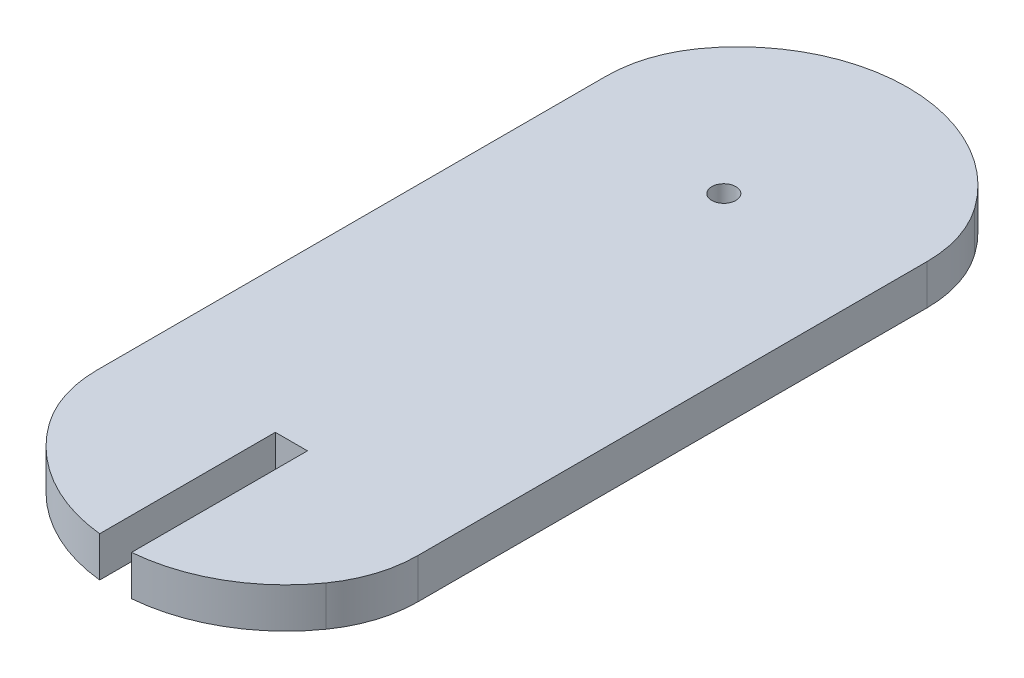
ISO-10303-21;
HEADER;
FILE_DESCRIPTION(('STEP AP214'),'2;1');
FILE_NAME('part.step','',(''),(''),'','','');
FILE_SCHEMA(('AUTOMOTIVE_DESIGN { 1 0 10303 214 1 1 1 1 }'));
ENDSEC;
DATA;
#1=APPLICATION_CONTEXT('core data for automotive mechanical design processes');
#2=APPLICATION_PROTOCOL_DEFINITION('international standard','automotive_design',2000,#1);
#3=PRODUCT_CONTEXT('',#1,'mechanical');
#4=PRODUCT('Part','Part','',(#3));
#5=PRODUCT_RELATED_PRODUCT_CATEGORY('part','',(#4));
#6=PRODUCT_DEFINITION_FORMATION('','',#4);
#7=PRODUCT_DEFINITION_CONTEXT('part definition',#1,'design');
#8=PRODUCT_DEFINITION('design','',#6,#7);
#9=PRODUCT_DEFINITION_SHAPE('','',#8);
#10=(LENGTH_UNIT() NAMED_UNIT(*) SI_UNIT(.MILLI.,.METRE.));
#11=(NAMED_UNIT(*) PLANE_ANGLE_UNIT() SI_UNIT($,.RADIAN.));
#12=(NAMED_UNIT(*) SI_UNIT($,.STERADIAN.) SOLID_ANGLE_UNIT());
#13=UNCERTAINTY_MEASURE_WITH_UNIT(LENGTH_MEASURE(1.E-05),#10,'distance_accuracy_value','');
#14=(GEOMETRIC_REPRESENTATION_CONTEXT(3) GLOBAL_UNCERTAINTY_ASSIGNED_CONTEXT((#13)) GLOBAL_UNIT_ASSIGNED_CONTEXT((#10,
#11,#12)) REPRESENTATION_CONTEXT('',''));
#15=CARTESIAN_POINT('',(0.,0.,0.));
#16=DIRECTION('',(0.,0.,1.));
#17=DIRECTION('',(1.,0.,0.));
#18=AXIS2_PLACEMENT_3D('',#15,#16,#17);
#19=CARTESIAN_POINT('',(0.,5.,28.1826031360937));
#20=DIRECTION('',(0.,-1.,0.));
#21=DIRECTION('',(0.,0.,-1.));
#22=AXIS2_PLACEMENT_3D('',#19,#20,#21);
#23=CYLINDRICAL_SURFACE('',#22,21.13);
#24=CARTESIAN_POINT('',(0.,5.,28.1826031360937));
#25=DIRECTION('',(0.,1.,0.));
#26=DIRECTION('',(0.,0.,1.));
#27=AXIS2_PLACEMENT_3D('',#24,#25,#26);
#28=CIRCLE('',#27,21.13);
#29=CARTESIAN_POINT('',(1.82374823296328,5.,49.2337513799012));
#30=VERTEX_POINT('',#29);
#31=CARTESIAN_POINT('',(17.2349102773246,5.,40.406954559894));
#32=VERTEX_POINT('',#31);
#33=EDGE_CURVE('E162',#30,#32,#28,.T.);
#34=ORIENTED_EDGE('',*,*,#33,.F.);
#35=DIRECTION('',(0.,-1.,0.));
#36=VECTOR('',#35,1.);
#37=CARTESIAN_POINT('',(1.82374823296328,5.,49.2337513799012));
#38=LINE('',#37,#36);
#39=CARTESIAN_POINT('',(1.82374823296328,0.,49.2337513799012));
#40=VERTEX_POINT('',#39);
#41=EDGE_CURVE('E156',#30,#40,#38,.T.);
#42=ORIENTED_EDGE('',*,*,#41,.T.);
#43=CARTESIAN_POINT('',(0.,0.,28.1826031360937));
#44=DIRECTION('',(0.,1.,0.));
#45=DIRECTION('',(0.,0.,1.));
#46=AXIS2_PLACEMENT_3D('',#43,#44,#45);
#47=CIRCLE('',#46,21.13);
#48=CARTESIAN_POINT('',(17.2349102773246,0.,40.406954559894));
#49=VERTEX_POINT('',#48);
#50=EDGE_CURVE('E159',#40,#49,#47,.T.);
#51=ORIENTED_EDGE('',*,*,#50,.T.);
#52=DIRECTION('',(0.,-1.,0.));
#53=VECTOR('',#52,1.);
#54=CARTESIAN_POINT('',(17.2349102773246,5.,40.406954559894));
#55=LINE('',#54,#53);
#56=EDGE_CURVE('E199',#49,#32,#55,.F.);
#57=ORIENTED_EDGE('',*,*,#56,.T.);
#58=EDGE_LOOP('',(#34,#42,#51,#57));
#59=FACE_BOUND('',#58,.T.);
#60=ADVANCED_FACE('F34',(#59),#23,.T.);
#61=CARTESIAN_POINT('',(-17.2349102773246,0.,40.406954559894));
#62=VERTEX_POINT('',#61);
#63=CARTESIAN_POINT('',(-2.17625176703672,0.,49.2002345023173));
#64=VERTEX_POINT('',#63);
#65=EDGE_CURVE('E171',#62,#64,#47,.T.);
#66=ORIENTED_EDGE('',*,*,#65,.T.);
#67=DIRECTION('',(0.,-1.,0.));
#68=VECTOR('',#67,1.);
#69=CARTESIAN_POINT('',(-2.17625176703672,5.,49.2002345023173));
#70=LINE('',#69,#68);
#71=CARTESIAN_POINT('',(-2.17625176703672,5.,49.2002345023173));
#72=VERTEX_POINT('',#71);
#73=EDGE_CURVE('E49',#64,#72,#70,.F.);
#74=ORIENTED_EDGE('',*,*,#73,.T.);
#75=CARTESIAN_POINT('',(-17.2349102773246,5.,40.406954559894));
#76=VERTEX_POINT('',#75);
#77=EDGE_CURVE('E142',#76,#72,#28,.T.);
#78=ORIENTED_EDGE('',*,*,#77,.F.);
#79=DIRECTION('',(0.,-1.,0.));
#80=VECTOR('',#79,1.);
#81=CARTESIAN_POINT('',(-17.2349102773246,5.,40.406954559894));
#82=LINE('',#81,#80);
#83=EDGE_CURVE('E196',#76,#62,#82,.T.);
#84=ORIENTED_EDGE('',*,*,#83,.T.);
#85=EDGE_LOOP('',(#66,#74,#78,#84));
#86=FACE_BOUND('',#85,.T.);
#87=ADVANCED_FACE('F238',(#86),#23,.T.);
#88=CARTESIAN_POINT('',(20.,5.,0.));
#89=DIRECTION('',(-1.,0.,0.));
#90=DIRECTION('',(0.,0.,1.));
#91=AXIS2_PLACEMENT_3D('',#88,#89,#90);
#92=PLANE('',#91);
#93=DIRECTION('',(0.,0.,-1.));
#94=VECTOR('',#93,1.);
#95=CARTESIAN_POINT('',(20.,5.,0.));
#96=LINE('',#95,#94);
#97=CARTESIAN_POINT('',(20.,5.,31.728995669359));
#98=VERTEX_POINT('',#97);
#99=CARTESIAN_POINT('',(20.,5.,-31.7243272605895));
#100=VERTEX_POINT('',#99);
#101=EDGE_CURVE('E161',#98,#100,#96,.T.);
#102=ORIENTED_EDGE('',*,*,#101,.F.);
#103=DIRECTION('',(0.,-1.,0.));
#104=VECTOR('',#103,1.);
#105=CARTESIAN_POINT('',(20.,5.,31.728995669359));
#106=LINE('',#105,#104);
#107=CARTESIAN_POINT('',(20.,0.,31.728995669359));
#108=VERTEX_POINT('',#107);
#109=EDGE_CURVE('E184',#98,#108,#106,.T.);
#110=ORIENTED_EDGE('',*,*,#109,.T.);
#111=DIRECTION('',(0.,0.,-1.));
#112=VECTOR('',#111,1.);
#113=CARTESIAN_POINT('',(20.,0.,0.));
#114=LINE('',#113,#112);
#115=CARTESIAN_POINT('',(20.,0.,-31.7243272605895));
#116=VERTEX_POINT('',#115);
#117=EDGE_CURVE('E174',#108,#116,#114,.T.);
#118=ORIENTED_EDGE('',*,*,#117,.T.);
#119=DIRECTION('',(0.,1.,0.));
#120=VECTOR('',#119,1.);
#121=CARTESIAN_POINT('',(20.,5.,-31.7243272605895));
#122=LINE('',#121,#120);
#123=EDGE_CURVE('E170',#116,#100,#122,.T.);
#124=ORIENTED_EDGE('',*,*,#123,.T.);
#125=EDGE_LOOP('',(#102,#110,#118,#124));
#126=FACE_BOUND('',#125,.T.);
#127=ADVANCED_FACE('F240',(#126),#92,.F.);
#128=CARTESIAN_POINT('',(0.,5.,-28.1720466483781));
#129=DIRECTION('',(0.,-1.,0.));
#130=DIRECTION('',(0.,0.,-1.));
#131=AXIS2_PLACEMENT_3D('',#128,#129,#130);
#132=CYLINDRICAL_SURFACE('',#131,21.1334083141344);
#133=CARTESIAN_POINT('',(0.,0.,-28.1720466483781));
#134=DIRECTION('',(0.,1.,0.));
#135=DIRECTION('',(0.,0.,1.));
#136=AXIS2_PLACEMENT_3D('',#133,#134,#135);
#137=CIRCLE('',#136,21.1334083141344);
#138=CARTESIAN_POINT('',(-17.2281113793065,0.,-40.4118638559239));
#139=VERTEX_POINT('',#138);
#140=CARTESIAN_POINT('',(17.2281113793065,0.,-40.4118638559239));
#141=VERTEX_POINT('',#140);
#142=EDGE_CURVE('E177',#139,#141,#137,.F.);
#143=ORIENTED_EDGE('',*,*,#142,.F.);
#144=DIRECTION('',(0.,-1.,0.));
#145=VECTOR('',#144,1.);
#146=CARTESIAN_POINT('',(-17.2281113793065,5.,-40.4118638559239));
#147=LINE('',#146,#145);
#148=CARTESIAN_POINT('',(-17.2281113793065,5.,-40.4118638559239));
#149=VERTEX_POINT('',#148);
#150=EDGE_CURVE('E42',#139,#149,#147,.F.);
#151=ORIENTED_EDGE('',*,*,#150,.T.);
#152=CARTESIAN_POINT('',(0.,5.,-28.1720466483781));
#153=DIRECTION('',(0.,1.,0.));
#154=DIRECTION('',(0.,0.,1.));
#155=AXIS2_PLACEMENT_3D('',#152,#153,#154);
#156=CIRCLE('',#155,21.1334083141344);
#157=CARTESIAN_POINT('',(17.2281113793065,5.,-40.4118638559239));
#158=VERTEX_POINT('',#157);
#159=EDGE_CURVE('E165',#149,#158,#156,.F.);
#160=ORIENTED_EDGE('',*,*,#159,.T.);
#161=DIRECTION('',(0.,-1.,0.));
#162=VECTOR('',#161,1.);
#163=CARTESIAN_POINT('',(17.2281113793065,5.,-40.4118638559239));
#164=LINE('',#163,#162);
#165=EDGE_CURVE('E214',#158,#141,#164,.T.);
#166=ORIENTED_EDGE('',*,*,#165,.T.);
#167=EDGE_LOOP('',(#143,#151,#160,#166));
#168=FACE_BOUND('',#167,.T.);
#169=ADVANCED_FACE('F219',(#168),#132,.T.);
#170=CARTESIAN_POINT('',(-20.,5.,0.));
#171=DIRECTION('',(-1.,0.,0.));
#172=DIRECTION('',(0.,0.,1.));
#173=AXIS2_PLACEMENT_3D('',#170,#171,#172);
#174=PLANE('',#173);
#175=DIRECTION('',(0.,0.,-1.));
#176=VECTOR('',#175,1.);
#177=CARTESIAN_POINT('',(-20.,0.,0.));
#178=LINE('',#177,#176);
#179=CARTESIAN_POINT('',(-20.,0.,31.728995669359));
#180=VERTEX_POINT('',#179);
#181=CARTESIAN_POINT('',(-20.,0.,-31.7243272605895));
#182=VERTEX_POINT('',#181);
#183=EDGE_CURVE('E180',#180,#182,#178,.T.);
#184=ORIENTED_EDGE('',*,*,#183,.F.);
#185=DIRECTION('',(0.,1.,0.));
#186=VECTOR('',#185,1.);
#187=CARTESIAN_POINT('',(-20.,5.,31.728995669359));
#188=LINE('',#187,#186);
#189=CARTESIAN_POINT('',(-20.,5.,31.728995669359));
#190=VERTEX_POINT('',#189);
#191=EDGE_CURVE('E212',#180,#190,#188,.T.);
#192=ORIENTED_EDGE('',*,*,#191,.T.);
#193=DIRECTION('',(0.,0.,-1.));
#194=VECTOR('',#193,1.);
#195=CARTESIAN_POINT('',(-20.,5.,0.));
#196=LINE('',#195,#194);
#197=CARTESIAN_POINT('',(-20.,5.,-31.7243272605895));
#198=VERTEX_POINT('',#197);
#199=EDGE_CURVE('E168',#190,#198,#196,.T.);
#200=ORIENTED_EDGE('',*,*,#199,.T.);
#201=DIRECTION('',(0.,-1.,0.));
#202=VECTOR('',#201,1.);
#203=CARTESIAN_POINT('',(-20.,5.,-31.7243272605895));
#204=LINE('',#203,#202);
#205=EDGE_CURVE('E209',#198,#182,#204,.T.);
#206=ORIENTED_EDGE('',*,*,#205,.T.);
#207=EDGE_LOOP('',(#184,#192,#200,#206));
#208=FACE_BOUND('',#207,.T.);
#209=ADVANCED_FACE('F227',(#208),#174,.T.);
#210=CARTESIAN_POINT('',(0.,5.,0.));
#211=DIRECTION('',(0.,1.,0.));
#212=DIRECTION('',(0.,0.,1.));
#213=AXIS2_PLACEMENT_3D('',#210,#211,#212);
#214=PLANE('',#213);
#215=CARTESIAN_POINT('',(0.,5.,-26.3873968639063));
#216=DIRECTION('',(0.,-1.,0.));
#217=DIRECTION('',(0.,0.,-1.));
#218=AXIS2_PLACEMENT_3D('',#215,#216,#217);
#219=CIRCLE('',#218,1.5);
#220=CARTESIAN_POINT('',(0.,5.,-27.8873968639063));
#221=VERTEX_POINT('',#220);
#222=EDGE_CURVE('E152',#221,#221,#219,.T.);
#223=ORIENTED_EDGE('',*,*,#222,.T.);
#224=EDGE_LOOP('',(#223));
#225=FACE_BOUND('',#224,.T.);
#226=DIRECTION('',(0.,0.,1.));
#227=VECTOR('',#226,1.);
#228=CARTESIAN_POINT('',(1.82374823296328,5.,49.3126031360937));
#229=LINE('',#228,#227);
#230=CARTESIAN_POINT('',(1.82374823296328,5.,27.3126031360937));
#231=VERTEX_POINT('',#230);
#232=EDGE_CURVE('E131',#231,#30,#229,.T.);
#233=ORIENTED_EDGE('',*,*,#232,.T.);
#234=ORIENTED_EDGE('',*,*,#33,.T.);
#235=CARTESIAN_POINT('',(5.,5.,31.728995669359));
#236=DIRECTION('',(0.,1.,0.));
#237=DIRECTION('',(0.,0.,1.));
#238=AXIS2_PLACEMENT_3D('',#235,#236,#237);
#239=CIRCLE('',#238,15.);
#240=EDGE_CURVE('E207',#32,#98,#239,.T.);
#241=ORIENTED_EDGE('',*,*,#240,.T.);
#242=ORIENTED_EDGE('',*,*,#101,.T.);
#243=CARTESIAN_POINT('',(5.,5.,-31.7243272605895));
#244=DIRECTION('',(0.,1.,0.));
#245=DIRECTION('',(0.,0.,1.));
#246=AXIS2_PLACEMENT_3D('',#243,#244,#245);
#247=CIRCLE('',#246,15.);
#248=EDGE_CURVE('E202',#100,#158,#247,.T.);
#249=ORIENTED_EDGE('',*,*,#248,.T.);
#250=ORIENTED_EDGE('',*,*,#159,.F.);
#251=CARTESIAN_POINT('',(-5.,5.,-31.7243272605895));
#252=DIRECTION('',(0.,1.,0.));
#253=DIRECTION('',(0.,0.,1.));
#254=AXIS2_PLACEMENT_3D('',#251,#252,#253);
#255=CIRCLE('',#254,15.);
#256=EDGE_CURVE('E56',#149,#198,#255,.T.);
#257=ORIENTED_EDGE('',*,*,#256,.T.);
#258=ORIENTED_EDGE('',*,*,#199,.F.);
#259=CARTESIAN_POINT('',(-5.,5.,31.728995669359));
#260=DIRECTION('',(0.,1.,0.));
#261=DIRECTION('',(0.,0.,1.));
#262=AXIS2_PLACEMENT_3D('',#259,#260,#261);
#263=CIRCLE('',#262,15.);
#264=EDGE_CURVE('E205',#190,#76,#263,.T.);
#265=ORIENTED_EDGE('',*,*,#264,.T.);
#266=ORIENTED_EDGE('',*,*,#77,.T.);
#267=DIRECTION('',(0.,0.,-1.));
#268=VECTOR('',#267,1.);
#269=CARTESIAN_POINT('',(-2.17625176703672,5.,27.3126031360937));
#270=LINE('',#269,#268);
#271=CARTESIAN_POINT('',(-2.17625176703672,5.,27.3126031360937));
#272=VERTEX_POINT('',#271);
#273=EDGE_CURVE('E126',#72,#272,#270,.T.);
#274=ORIENTED_EDGE('',*,*,#273,.T.);
#275=DIRECTION('',(1.,0.,0.));
#276=VECTOR('',#275,1.);
#277=CARTESIAN_POINT('',(1.82374823296328,5.,27.3126031360937));
#278=LINE('',#277,#276);
#279=EDGE_CURVE('E134',#272,#231,#278,.T.);
#280=ORIENTED_EDGE('',*,*,#279,.T.);
#281=EDGE_LOOP('',(#233,#234,#241,#242,#249,#250,#257,#258,#265,#266,#274,#280));
#282=FACE_BOUND('',#281,.T.);
#283=ADVANCED_FACE('F140',(#225,#282),#214,.T.);
#284=CARTESIAN_POINT('',(0.,0.,0.));
#285=DIRECTION('',(0.,1.,0.));
#286=DIRECTION('',(0.,0.,1.));
#287=AXIS2_PLACEMENT_3D('',#284,#285,#286);
#288=PLANE('',#287);
#289=CARTESIAN_POINT('',(0.,0.,-26.3873968639063));
#290=DIRECTION('',(0.,-1.,0.));
#291=DIRECTION('',(0.,0.,-1.));
#292=AXIS2_PLACEMENT_3D('',#289,#290,#291);
#293=CIRCLE('',#292,1.5);
#294=CARTESIAN_POINT('',(0.,0.,-27.8873968639063));
#295=VERTEX_POINT('',#294);
#296=EDGE_CURVE('E148',#295,#295,#293,.T.);
#297=ORIENTED_EDGE('',*,*,#296,.F.);
#298=EDGE_LOOP('',(#297));
#299=FACE_BOUND('',#298,.T.);
#300=ORIENTED_EDGE('',*,*,#50,.F.);
#301=DIRECTION('',(0.,0.,1.));
#302=VECTOR('',#301,1.);
#303=CARTESIAN_POINT('',(1.82374823296328,0.,49.3126031360937));
#304=LINE('',#303,#302);
#305=CARTESIAN_POINT('',(1.82374823296328,0.,27.3126031360937));
#306=VERTEX_POINT('',#305);
#307=EDGE_CURVE('E143',#306,#40,#304,.T.);
#308=ORIENTED_EDGE('',*,*,#307,.F.);
#309=DIRECTION('',(1.,0.,0.));
#310=VECTOR('',#309,1.);
#311=CARTESIAN_POINT('',(1.82374823296328,0.,27.3126031360937));
#312=LINE('',#311,#310);
#313=CARTESIAN_POINT('',(-2.17625176703672,0.,27.3126031360937));
#314=VERTEX_POINT('',#313);
#315=EDGE_CURVE('E145',#314,#306,#312,.T.);
#316=ORIENTED_EDGE('',*,*,#315,.F.);
#317=DIRECTION('',(0.,0.,1.));
#318=VECTOR('',#317,1.);
#319=CARTESIAN_POINT('',(-2.17625176703671,0.,0.));
#320=LINE('',#319,#318);
#321=EDGE_CURVE('E11',#314,#64,#320,.T.);
#322=ORIENTED_EDGE('',*,*,#321,.T.);
#323=ORIENTED_EDGE('',*,*,#65,.F.);
#324=CARTESIAN_POINT('',(-5.,0.,31.728995669359));
#325=DIRECTION('',(0.,1.,0.));
#326=DIRECTION('',(0.,0.,1.));
#327=AXIS2_PLACEMENT_3D('',#324,#325,#326);
#328=CIRCLE('',#327,15.);
#329=EDGE_CURVE('E191',#62,#180,#328,.F.);
#330=ORIENTED_EDGE('',*,*,#329,.T.);
#331=ORIENTED_EDGE('',*,*,#183,.T.);
#332=CARTESIAN_POINT('',(-5.,0.,-31.7243272605895));
#333=DIRECTION('',(0.,1.,0.));
#334=DIRECTION('',(0.,0.,1.));
#335=AXIS2_PLACEMENT_3D('',#332,#333,#334);
#336=CIRCLE('',#335,15.);
#337=EDGE_CURVE('E189',#182,#139,#336,.F.);
#338=ORIENTED_EDGE('',*,*,#337,.T.);
#339=ORIENTED_EDGE('',*,*,#142,.T.);
#340=CARTESIAN_POINT('',(5.,0.,-31.7243272605895));
#341=DIRECTION('',(0.,1.,0.));
#342=DIRECTION('',(0.,0.,1.));
#343=AXIS2_PLACEMENT_3D('',#340,#341,#342);
#344=CIRCLE('',#343,15.);
#345=EDGE_CURVE('E187',#141,#116,#344,.F.);
#346=ORIENTED_EDGE('',*,*,#345,.T.);
#347=ORIENTED_EDGE('',*,*,#117,.F.);
#348=CARTESIAN_POINT('',(5.,0.,31.728995669359));
#349=DIRECTION('',(0.,1.,0.));
#350=DIRECTION('',(0.,0.,1.));
#351=AXIS2_PLACEMENT_3D('',#348,#349,#350);
#352=CIRCLE('',#351,15.);
#353=EDGE_CURVE('E193',#108,#49,#352,.F.);
#354=ORIENTED_EDGE('',*,*,#353,.T.);
#355=EDGE_LOOP('',(#300,#308,#316,#322,#323,#330,#331,#338,#339,#346,#347,#354));
#356=FACE_BOUND('',#355,.T.);
#357=ADVANCED_FACE('F231',(#299,#356),#288,.F.);
#358=CARTESIAN_POINT('',(5.,5.,31.728995669359));
#359=DIRECTION('',(0.,-1.,0.));
#360=DIRECTION('',(0.,0.,-1.));
#361=AXIS2_PLACEMENT_3D('',#358,#359,#360);
#362=CYLINDRICAL_SURFACE('',#361,15.);
#363=ORIENTED_EDGE('',*,*,#240,.F.);
#364=ORIENTED_EDGE('',*,*,#56,.F.);
#365=ORIENTED_EDGE('',*,*,#353,.F.);
#366=ORIENTED_EDGE('',*,*,#109,.F.);
#367=EDGE_LOOP('',(#363,#364,#365,#366));
#368=FACE_BOUND('',#367,.T.);
#369=ADVANCED_FACE('F251',(#368),#362,.T.);
#370=CARTESIAN_POINT('',(-5.,5.,31.728995669359));
#371=DIRECTION('',(0.,-1.,0.));
#372=DIRECTION('',(0.,0.,-1.));
#373=AXIS2_PLACEMENT_3D('',#370,#371,#372);
#374=CYLINDRICAL_SURFACE('',#373,15.);
#375=ORIENTED_EDGE('',*,*,#264,.F.);
#376=ORIENTED_EDGE('',*,*,#191,.F.);
#377=ORIENTED_EDGE('',*,*,#329,.F.);
#378=ORIENTED_EDGE('',*,*,#83,.F.);
#379=EDGE_LOOP('',(#375,#376,#377,#378));
#380=FACE_BOUND('',#379,.T.);
#381=ADVANCED_FACE('F236',(#380),#374,.T.);
#382=CARTESIAN_POINT('',(-5.,5.,-31.7243272605895));
#383=DIRECTION('',(0.,-1.,0.));
#384=DIRECTION('',(0.,0.,-1.));
#385=AXIS2_PLACEMENT_3D('',#382,#383,#384);
#386=CYLINDRICAL_SURFACE('',#385,15.);
#387=ORIENTED_EDGE('',*,*,#256,.F.);
#388=ORIENTED_EDGE('',*,*,#150,.F.);
#389=ORIENTED_EDGE('',*,*,#337,.F.);
#390=ORIENTED_EDGE('',*,*,#205,.F.);
#391=EDGE_LOOP('',(#387,#388,#389,#390));
#392=FACE_BOUND('',#391,.T.);
#393=ADVANCED_FACE('F224',(#392),#386,.T.);
#394=CARTESIAN_POINT('',(5.,5.,-31.7243272605895));
#395=DIRECTION('',(0.,-1.,0.));
#396=DIRECTION('',(0.,0.,-1.));
#397=AXIS2_PLACEMENT_3D('',#394,#395,#396);
#398=CYLINDRICAL_SURFACE('',#397,15.);
#399=ORIENTED_EDGE('',*,*,#248,.F.);
#400=ORIENTED_EDGE('',*,*,#123,.F.);
#401=ORIENTED_EDGE('',*,*,#345,.F.);
#402=ORIENTED_EDGE('',*,*,#165,.F.);
#403=EDGE_LOOP('',(#399,#400,#401,#402));
#404=FACE_BOUND('',#403,.T.);
#405=ADVANCED_FACE('F36',(#404),#398,.T.);
#406=CARTESIAN_POINT('',(1.82374823296328,5.,49.3126031360937));
#407=DIRECTION('',(1.,0.,0.));
#408=DIRECTION('',(0.,0.,-1.));
#409=AXIS2_PLACEMENT_3D('',#406,#407,#408);
#410=PLANE('',#409);
#411=ORIENTED_EDGE('',*,*,#232,.F.);
#412=DIRECTION('',(0.,-1.,0.));
#413=VECTOR('',#412,1.);
#414=CARTESIAN_POINT('',(1.82374823296328,5.,27.3126031360937));
#415=LINE('',#414,#413);
#416=EDGE_CURVE('E130',#231,#306,#415,.T.);
#417=ORIENTED_EDGE('',*,*,#416,.T.);
#418=ORIENTED_EDGE('',*,*,#307,.T.);
#419=ORIENTED_EDGE('',*,*,#41,.F.);
#420=EDGE_LOOP('',(#411,#417,#418,#419));
#421=FACE_BOUND('',#420,.T.);
#422=ADVANCED_FACE('F260',(#421),#410,.F.);
#423=CARTESIAN_POINT('',(-2.17625176703672,5.,27.3126031360937));
#424=DIRECTION('',(-1.,0.,0.));
#425=DIRECTION('',(0.,0.,1.));
#426=AXIS2_PLACEMENT_3D('',#423,#424,#425);
#427=PLANE('',#426);
#428=ORIENTED_EDGE('',*,*,#321,.F.);
#429=DIRECTION('',(0.,-1.,0.));
#430=VECTOR('',#429,1.);
#431=CARTESIAN_POINT('',(-2.17625176703672,5.,27.3126031360937));
#432=LINE('',#431,#430);
#433=EDGE_CURVE('E122',#272,#314,#432,.T.);
#434=ORIENTED_EDGE('',*,*,#433,.F.);
#435=ORIENTED_EDGE('',*,*,#273,.F.);
#436=ORIENTED_EDGE('',*,*,#73,.F.);
#437=EDGE_LOOP('',(#428,#434,#435,#436));
#438=FACE_BOUND('',#437,.T.);
#439=ADVANCED_FACE('F124',(#438),#427,.F.);
#440=CARTESIAN_POINT('',(1.82374823296328,5.,27.3126031360937));
#441=DIRECTION('',(0.,0.,-1.));
#442=DIRECTION('',(-1.,0.,0.));
#443=AXIS2_PLACEMENT_3D('',#440,#441,#442);
#444=PLANE('',#443);
#445=ORIENTED_EDGE('',*,*,#315,.T.);
#446=ORIENTED_EDGE('',*,*,#416,.F.);
#447=ORIENTED_EDGE('',*,*,#279,.F.);
#448=ORIENTED_EDGE('',*,*,#433,.T.);
#449=EDGE_LOOP('',(#445,#446,#447,#448));
#450=FACE_BOUND('',#449,.T.);
#451=ADVANCED_FACE('F135',(#450),#444,.F.);
#452=CARTESIAN_POINT('',(0.,5.,-26.3873968639063));
#453=DIRECTION('',(0.,-1.,0.));
#454=DIRECTION('',(0.,0.,-1.));
#455=AXIS2_PLACEMENT_3D('',#452,#453,#454);
#456=CYLINDRICAL_SURFACE('',#455,1.5);
#457=ORIENTED_EDGE('',*,*,#222,.F.);
#458=EDGE_LOOP('',(#457));
#459=FACE_BOUND('',#458,.T.);
#460=ORIENTED_EDGE('',*,*,#296,.T.);
#461=EDGE_LOOP('',(#460));
#462=FACE_BOUND('',#461,.T.);
#463=ADVANCED_FACE('F281',(#459,#462),#456,.F.);
#464=CLOSED_SHELL('',(#60,#87,#127,#169,#209,#283,#357,#369,#381,#393,#405,#422,#439,#451,#463));
#465=MANIFOLD_SOLID_BREP('B2',#464);
#466=ADVANCED_BREP_SHAPE_REPRESENTATION('',(#18,#465),#14);
#467=SHAPE_DEFINITION_REPRESENTATION(#9,#466);
ENDSEC;
END-ISO-10303-21;
